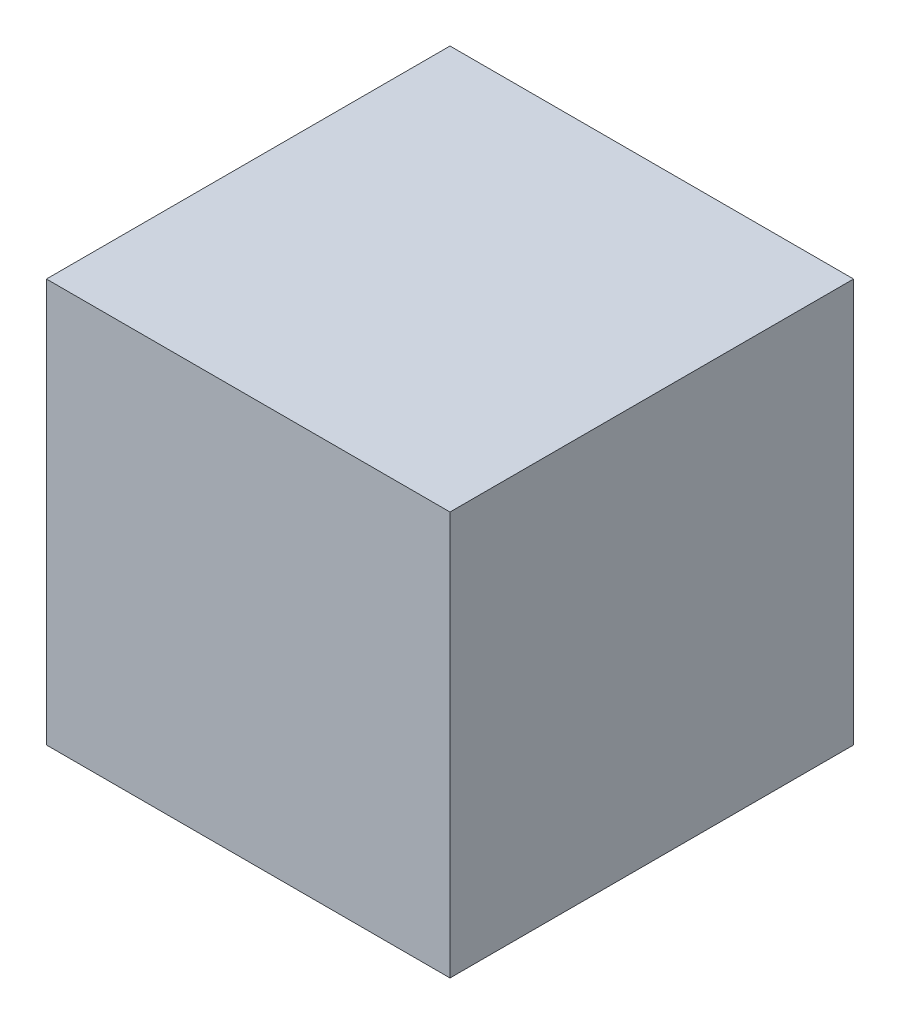
ISO-10303-21;
HEADER;
FILE_DESCRIPTION(('STEP AP214'),'2;1');
FILE_NAME('part.step','',(''),(''),'','','');
FILE_SCHEMA(('AUTOMOTIVE_DESIGN { 1 0 10303 214 1 1 1 1 }'));
ENDSEC;
DATA;
#1=APPLICATION_CONTEXT('core data for automotive mechanical design processes');
#2=APPLICATION_PROTOCOL_DEFINITION('international standard','automotive_design',2000,#1);
#3=PRODUCT_CONTEXT('',#1,'mechanical');
#4=PRODUCT('Part','Part','',(#3));
#5=PRODUCT_RELATED_PRODUCT_CATEGORY('part','',(#4));
#6=PRODUCT_DEFINITION_FORMATION('','',#4);
#7=PRODUCT_DEFINITION_CONTEXT('part definition',#1,'design');
#8=PRODUCT_DEFINITION('design','',#6,#7);
#9=PRODUCT_DEFINITION_SHAPE('','',#8);
#10=(LENGTH_UNIT() NAMED_UNIT(*) SI_UNIT(.MILLI.,.METRE.));
#11=(NAMED_UNIT(*) PLANE_ANGLE_UNIT() SI_UNIT($,.RADIAN.));
#12=(NAMED_UNIT(*) SI_UNIT($,.STERADIAN.) SOLID_ANGLE_UNIT());
#13=UNCERTAINTY_MEASURE_WITH_UNIT(LENGTH_MEASURE(1.E-05),#10,'distance_accuracy_value','');
#14=(GEOMETRIC_REPRESENTATION_CONTEXT(3) GLOBAL_UNCERTAINTY_ASSIGNED_CONTEXT((#13)) GLOBAL_UNIT_ASSIGNED_CONTEXT((#10,
#11,#12)) REPRESENTATION_CONTEXT('',''));
#15=CARTESIAN_POINT('',(0.,0.,0.));
#16=DIRECTION('',(0.,0.,1.));
#17=DIRECTION('',(1.,0.,0.));
#18=AXIS2_PLACEMENT_3D('',#15,#16,#17);
#19=CARTESIAN_POINT('',(0.,10.,0.));
#20=DIRECTION('',(1.,0.,0.));
#21=DIRECTION('',(0.,0.,-1.));
#22=AXIS2_PLACEMENT_3D('',#19,#20,#21);
#23=PLANE('',#22);
#24=DIRECTION('',(0.,0.,1.));
#25=VECTOR('',#24,1.);
#26=CARTESIAN_POINT('',(0.,0.,0.));
#27=LINE('',#26,#25);
#28=CARTESIAN_POINT('',(0.,0.,-10.));
#29=VERTEX_POINT('',#28);
#30=CARTESIAN_POINT('',(0.,0.,0.));
#31=VERTEX_POINT('',#30);
#32=EDGE_CURVE('E74',#29,#31,#27,.T.);
#33=ORIENTED_EDGE('',*,*,#32,.T.);
#34=DIRECTION('',(0.,-1.,0.));
#35=VECTOR('',#34,1.);
#36=CARTESIAN_POINT('',(0.,10.,0.));
#37=LINE('',#36,#35);
#38=CARTESIAN_POINT('',(0.,10.,0.));
#39=VERTEX_POINT('',#38);
#40=EDGE_CURVE('E11',#39,#31,#37,.T.);
#41=ORIENTED_EDGE('',*,*,#40,.F.);
#42=DIRECTION('',(0.,0.,1.));
#43=VECTOR('',#42,1.);
#44=CARTESIAN_POINT('',(0.,10.,0.));
#45=LINE('',#44,#43);
#46=CARTESIAN_POINT('',(0.,10.,-10.));
#47=VERTEX_POINT('',#46);
#48=EDGE_CURVE('E92',#47,#39,#45,.T.);
#49=ORIENTED_EDGE('',*,*,#48,.F.);
#50=DIRECTION('',(0.,-1.,0.));
#51=VECTOR('',#50,1.);
#52=CARTESIAN_POINT('',(0.,10.,-10.));
#53=LINE('',#52,#51);
#54=EDGE_CURVE('E86',#47,#29,#53,.T.);
#55=ORIENTED_EDGE('',*,*,#54,.T.);
#56=EDGE_LOOP('',(#33,#41,#49,#55));
#57=FACE_BOUND('',#56,.T.);
#58=ADVANCED_FACE('F30',(#57),#23,.F.);
#59=CARTESIAN_POINT('',(0.,10.,0.));
#60=DIRECTION('',(0.,0.,-1.));
#61=DIRECTION('',(-1.,0.,0.));
#62=AXIS2_PLACEMENT_3D('',#59,#60,#61);
#63=PLANE('',#62);
#64=DIRECTION('',(1.,0.,0.));
#65=VECTOR('',#64,1.);
#66=CARTESIAN_POINT('',(0.,0.,0.));
#67=LINE('',#66,#65);
#68=CARTESIAN_POINT('',(10.,0.,0.));
#69=VERTEX_POINT('',#68);
#70=EDGE_CURVE('E70',#31,#69,#67,.T.);
#71=ORIENTED_EDGE('',*,*,#70,.T.);
#72=DIRECTION('',(0.,-1.,0.));
#73=VECTOR('',#72,1.);
#74=CARTESIAN_POINT('',(10.,10.,0.));
#75=LINE('',#74,#73);
#76=CARTESIAN_POINT('',(10.,10.,0.));
#77=VERTEX_POINT('',#76);
#78=EDGE_CURVE('E37',#77,#69,#75,.T.);
#79=ORIENTED_EDGE('',*,*,#78,.F.);
#80=DIRECTION('',(1.,0.,0.));
#81=VECTOR('',#80,1.);
#82=CARTESIAN_POINT('',(0.,10.,0.));
#83=LINE('',#82,#81);
#84=EDGE_CURVE('E82',#39,#77,#83,.T.);
#85=ORIENTED_EDGE('',*,*,#84,.F.);
#86=ORIENTED_EDGE('',*,*,#40,.T.);
#87=EDGE_LOOP('',(#71,#79,#85,#86));
#88=FACE_BOUND('',#87,.T.);
#89=ADVANCED_FACE('F81',(#88),#63,.F.);
#90=CARTESIAN_POINT('',(10.,10.,0.));
#91=DIRECTION('',(-1.,0.,0.));
#92=DIRECTION('',(0.,0.,1.));
#93=AXIS2_PLACEMENT_3D('',#90,#91,#92);
#94=PLANE('',#93);
#95=DIRECTION('',(0.,0.,-1.));
#96=VECTOR('',#95,1.);
#97=CARTESIAN_POINT('',(10.,0.,0.));
#98=LINE('',#97,#96);
#99=CARTESIAN_POINT('',(10.,0.,-10.));
#100=VERTEX_POINT('',#99);
#101=EDGE_CURVE('E75',#69,#100,#98,.T.);
#102=ORIENTED_EDGE('',*,*,#101,.T.);
#103=DIRECTION('',(0.,-1.,0.));
#104=VECTOR('',#103,1.);
#105=CARTESIAN_POINT('',(10.,10.,-10.));
#106=LINE('',#105,#104);
#107=CARTESIAN_POINT('',(10.,10.,-10.));
#108=VERTEX_POINT('',#107);
#109=EDGE_CURVE('E98',#108,#100,#106,.T.);
#110=ORIENTED_EDGE('',*,*,#109,.F.);
#111=DIRECTION('',(0.,0.,-1.));
#112=VECTOR('',#111,1.);
#113=CARTESIAN_POINT('',(10.,10.,0.));
#114=LINE('',#113,#112);
#115=EDGE_CURVE('E49',#77,#108,#114,.T.);
#116=ORIENTED_EDGE('',*,*,#115,.F.);
#117=ORIENTED_EDGE('',*,*,#78,.T.);
#118=EDGE_LOOP('',(#102,#110,#116,#117));
#119=FACE_BOUND('',#118,.T.);
#120=ADVANCED_FACE('F101',(#119),#94,.F.);
#121=CARTESIAN_POINT('',(0.,10.,-10.));
#122=DIRECTION('',(0.,0.,1.));
#123=DIRECTION('',(1.,0.,0.));
#124=AXIS2_PLACEMENT_3D('',#121,#122,#123);
#125=PLANE('',#124);
#126=DIRECTION('',(-1.,0.,0.));
#127=VECTOR('',#126,1.);
#128=CARTESIAN_POINT('',(0.,0.,-10.));
#129=LINE('',#128,#127);
#130=EDGE_CURVE('E90',#100,#29,#129,.T.);
#131=ORIENTED_EDGE('',*,*,#130,.T.);
#132=ORIENTED_EDGE('',*,*,#54,.F.);
#133=DIRECTION('',(-1.,0.,0.));
#134=VECTOR('',#133,1.);
#135=CARTESIAN_POINT('',(0.,10.,-10.));
#136=LINE('',#135,#134);
#137=EDGE_CURVE('E44',#108,#47,#136,.T.);
#138=ORIENTED_EDGE('',*,*,#137,.F.);
#139=ORIENTED_EDGE('',*,*,#109,.T.);
#140=EDGE_LOOP('',(#131,#132,#138,#139));
#141=FACE_BOUND('',#140,.T.);
#142=ADVANCED_FACE('F103',(#141),#125,.F.);
#143=CARTESIAN_POINT('',(0.,10.,-10.));
#144=DIRECTION('',(0.,-1.,0.));
#145=DIRECTION('',(0.,0.,-1.));
#146=AXIS2_PLACEMENT_3D('',#143,#144,#145);
#147=PLANE('',#146);
#148=ORIENTED_EDGE('',*,*,#48,.T.);
#149=ORIENTED_EDGE('',*,*,#84,.T.);
#150=ORIENTED_EDGE('',*,*,#115,.T.);
#151=ORIENTED_EDGE('',*,*,#137,.T.);
#152=EDGE_LOOP('',(#148,#149,#150,#151));
#153=FACE_BOUND('',#152,.T.);
#154=ADVANCED_FACE('F104',(#153),#147,.F.);
#155=CARTESIAN_POINT('',(0.,0.,-10.));
#156=DIRECTION('',(0.,-1.,0.));
#157=DIRECTION('',(0.,0.,-1.));
#158=AXIS2_PLACEMENT_3D('',#155,#156,#157);
#159=PLANE('',#158);
#160=ORIENTED_EDGE('',*,*,#32,.F.);
#161=ORIENTED_EDGE('',*,*,#130,.F.);
#162=ORIENTED_EDGE('',*,*,#101,.F.);
#163=ORIENTED_EDGE('',*,*,#70,.F.);
#164=EDGE_LOOP('',(#160,#161,#162,#163));
#165=FACE_BOUND('',#164,.T.);
#166=ADVANCED_FACE('F71',(#165),#159,.T.);
#167=CLOSED_SHELL('',(#58,#89,#120,#142,#154,#166));
#168=MANIFOLD_SOLID_BREP('B2',#167);
#169=ADVANCED_BREP_SHAPE_REPRESENTATION('',(#18,#168),#14);
#170=SHAPE_DEFINITION_REPRESENTATION(#9,#169);
ENDSEC;
END-ISO-10303-21;
